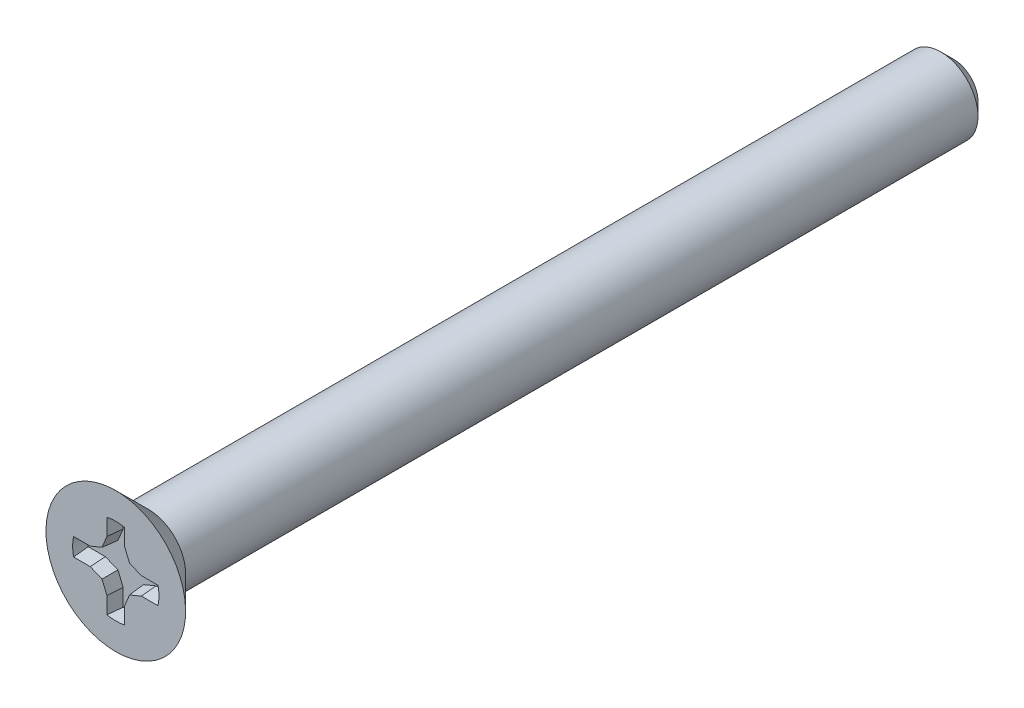
ISO-10303-21;
HEADER;
FILE_DESCRIPTION(('STEP AP214'),'2;1');
FILE_NAME('part.step','',(''),(''),'','','');
FILE_SCHEMA(('AUTOMOTIVE_DESIGN { 1 0 10303 214 1 1 1 1 }'));
ENDSEC;
DATA;
#1=APPLICATION_CONTEXT('core data for automotive mechanical design processes');
#2=APPLICATION_PROTOCOL_DEFINITION('international standard','automotive_design',2000,#1);
#3=PRODUCT_CONTEXT('',#1,'mechanical');
#4=PRODUCT('Part','Part','',(#3));
#5=PRODUCT_RELATED_PRODUCT_CATEGORY('part','',(#4));
#6=PRODUCT_DEFINITION_FORMATION('','',#4);
#7=PRODUCT_DEFINITION_CONTEXT('part definition',#1,'design');
#8=PRODUCT_DEFINITION('design','',#6,#7);
#9=PRODUCT_DEFINITION_SHAPE('','',#8);
#10=(LENGTH_UNIT() NAMED_UNIT(*) SI_UNIT(.MILLI.,.METRE.));
#11=(NAMED_UNIT(*) PLANE_ANGLE_UNIT() SI_UNIT($,.RADIAN.));
#12=(NAMED_UNIT(*) SI_UNIT($,.STERADIAN.) SOLID_ANGLE_UNIT());
#13=UNCERTAINTY_MEASURE_WITH_UNIT(LENGTH_MEASURE(1.E-05),#10,'distance_accuracy_value','');
#14=(GEOMETRIC_REPRESENTATION_CONTEXT(3) GLOBAL_UNCERTAINTY_ASSIGNED_CONTEXT((#13)) GLOBAL_UNIT_ASSIGNED_CONTEXT((#10,
#11,#12)) REPRESENTATION_CONTEXT('',''));
#15=CARTESIAN_POINT('',(0.,0.,0.));
#16=DIRECTION('',(0.,0.,1.));
#17=DIRECTION('',(1.,0.,0.));
#18=AXIS2_PLACEMENT_3D('',#15,#16,#17);
#19=CARTESIAN_POINT('',(0.,0.,0.96));
#20=DIRECTION('',(0.,0.,-1.));
#21=DIRECTION('',(0.,1.,0.));
#22=AXIS2_PLACEMENT_3D('',#19,#20,#21);
#23=PLANE('',#22);
#24=CARTESIAN_POINT('',(0.,0.,0.96));
#25=DIRECTION('',(0.,0.,1.));
#26=DIRECTION('',(0.,-1.,0.));
#27=AXIS2_PLACEMENT_3D('',#24,#25,#26);
#28=CIRCLE('',#27,1.5);
#29=CARTESIAN_POINT('',(0.,-1.5,0.96));
#30=VERTEX_POINT('',#29);
#31=EDGE_CURVE('E182',#30,#30,#28,.T.);
#32=ORIENTED_EDGE('',*,*,#31,.T.);
#33=EDGE_LOOP('',(#32));
#34=FACE_BOUND('',#33,.T.);
#35=CARTESIAN_POINT('',(0.,0.,0.96));
#36=DIRECTION('',(0.,0.,1.));
#37=DIRECTION('',(1.,0.,0.));
#38=AXIS2_PLACEMENT_3D('',#35,#36,#37);
#39=CIRCLE('',#38,0.927100000000001);
#40=CARTESIAN_POINT('',(0.90731701185418,-0.190500000000004,0.96));
#41=VERTEX_POINT('',#40);
#42=CARTESIAN_POINT('',(0.907317011854182,0.190500000000001,0.96));
#43=VERTEX_POINT('',#42);
#44=EDGE_CURVE('E200',#41,#43,#39,.T.);
#45=ORIENTED_EDGE('',*,*,#44,.F.);
#46=DIRECTION('',(-1.,0.,0.));
#47=VECTOR('',#46,1.);
#48=CARTESIAN_POINT('',(0.,-0.190500000000001,0.96));
#49=LINE('',#48,#47);
#50=CARTESIAN_POINT('',(0.548908505927091,-0.190500000000003,0.96));
#51=VERTEX_POINT('',#50);
#52=EDGE_CURVE('E210',#41,#51,#49,.T.);
#53=ORIENTED_EDGE('',*,*,#52,.T.);
#54=DIRECTION('',(-0.923879532511288,-0.382683432365088,0.));
#55=VECTOR('',#54,1.);
#56=CARTESIAN_POINT('',(0.147737710475553,-0.356670384304032,0.96));
#57=LINE('',#56,#55);
#58=CARTESIAN_POINT('',(0.295475420951106,-0.295475420951108,0.96));
#59=VERTEX_POINT('',#58);
#60=EDGE_CURVE('E214',#51,#59,#57,.T.);
#61=ORIENTED_EDGE('',*,*,#60,.T.);
#62=DIRECTION('',(-0.382683432365094,-0.923879532511285,0.));
#63=VECTOR('',#62,1.);
#64=CARTESIAN_POINT('',(0.356670384304031,-0.147737710475555,0.96));
#65=LINE('',#64,#63);
#66=CARTESIAN_POINT('',(0.190499999999999,-0.548908505927092,0.96));
#67=VERTEX_POINT('',#66);
#68=EDGE_CURVE('E218',#59,#67,#65,.T.);
#69=ORIENTED_EDGE('',*,*,#68,.T.);
#70=DIRECTION('',(0.,1.,0.));
#71=VECTOR('',#70,1.);
#72=CARTESIAN_POINT('',(0.190500000000001,0.,0.96));
#73=LINE('',#72,#71);
#74=CARTESIAN_POINT('',(0.190499999999998,-0.907317011854183,0.96));
#75=VERTEX_POINT('',#74);
#76=EDGE_CURVE('E222',#75,#67,#73,.T.);
#77=ORIENTED_EDGE('',*,*,#76,.F.);
#78=CARTESIAN_POINT('',(0.,0.,0.96));
#79=DIRECTION('',(0.,0.,1.));
#80=DIRECTION('',(0.,-1.,0.));
#81=AXIS2_PLACEMENT_3D('',#78,#79,#80);
#82=CIRCLE('',#81,0.927100000000001);
#83=CARTESIAN_POINT('',(-0.190500000000001,-0.907317011854181,0.96));
#84=VERTEX_POINT('',#83);
#85=EDGE_CURVE('E228',#84,#75,#82,.T.);
#86=ORIENTED_EDGE('',*,*,#85,.F.);
#87=DIRECTION('',(0.,1.,0.));
#88=VECTOR('',#87,1.);
#89=CARTESIAN_POINT('',(-0.190500000000001,0.,0.96));
#90=LINE('',#89,#88);
#91=CARTESIAN_POINT('',(-0.190500000000001,-0.548908505927091,0.96));
#92=VERTEX_POINT('',#91);
#93=EDGE_CURVE('E232',#84,#92,#90,.T.);
#94=ORIENTED_EDGE('',*,*,#93,.T.);
#95=DIRECTION('',(-0.382683432365091,0.923879532511286,0.));
#96=VECTOR('',#95,1.);
#97=CARTESIAN_POINT('',(-0.356670384304031,-0.147737710475554,0.96));
#98=LINE('',#97,#96);
#99=CARTESIAN_POINT('',(-0.295475420951107,-0.295475420951107,0.96));
#100=VERTEX_POINT('',#99);
#101=EDGE_CURVE('E236',#92,#100,#98,.T.);
#102=ORIENTED_EDGE('',*,*,#101,.T.);
#103=DIRECTION('',(-0.923879532511287,0.38268343236509,0.));
#104=VECTOR('',#103,1.);
#105=CARTESIAN_POINT('',(-0.147737710475554,-0.356670384304031,0.96));
#106=LINE('',#105,#104);
#107=CARTESIAN_POINT('',(-0.548908505927092,-0.190500000000001,0.96));
#108=VERTEX_POINT('',#107);
#109=EDGE_CURVE('E240',#100,#108,#106,.T.);
#110=ORIENTED_EDGE('',*,*,#109,.T.);
#111=DIRECTION('',(1.,0.,0.));
#112=VECTOR('',#111,1.);
#113=CARTESIAN_POINT('',(0.,-0.190500000000001,0.96));
#114=LINE('',#113,#112);
#115=CARTESIAN_POINT('',(-0.907317011854182,-0.190500000000001,0.96));
#116=VERTEX_POINT('',#115);
#117=EDGE_CURVE('E244',#116,#108,#114,.T.);
#118=ORIENTED_EDGE('',*,*,#117,.F.);
#119=CARTESIAN_POINT('',(0.,0.,0.96));
#120=DIRECTION('',(0.,0.,1.));
#121=DIRECTION('',(-1.,0.,0.));
#122=AXIS2_PLACEMENT_3D('',#119,#120,#121);
#123=CIRCLE('',#122,0.927100000000001);
#124=CARTESIAN_POINT('',(-0.907317011854179,0.190500000000011,0.96));
#125=VERTEX_POINT('',#124);
#126=EDGE_CURVE('E248',#125,#116,#123,.T.);
#127=ORIENTED_EDGE('',*,*,#126,.F.);
#128=DIRECTION('',(1.,0.,0.));
#129=VECTOR('',#128,1.);
#130=CARTESIAN_POINT('',(0.,0.190500000000001,0.96));
#131=LINE('',#130,#129);
#132=CARTESIAN_POINT('',(-0.548908505927089,0.190500000000007,0.96));
#133=VERTEX_POINT('',#132);
#134=EDGE_CURVE('E181',#125,#133,#131,.T.);
#135=ORIENTED_EDGE('',*,*,#134,.T.);
#136=DIRECTION('',(0.92387953251129,0.382683432365081,0.));
#137=VECTOR('',#136,1.);
#138=CARTESIAN_POINT('',(-0.14773771047555,0.356670384304033,0.96));
#139=LINE('',#138,#137);
#140=CARTESIAN_POINT('',(-0.295475420951104,0.295475420951111,0.96));
#141=VERTEX_POINT('',#140);
#142=EDGE_CURVE('E172',#133,#141,#139,.T.);
#143=ORIENTED_EDGE('',*,*,#142,.T.);
#144=DIRECTION('',(0.3826834323651,0.923879532511283,0.));
#145=VECTOR('',#144,1.);
#146=CARTESIAN_POINT('',(-0.35667038430403,0.147737710475558,0.96));
#147=LINE('',#146,#145);
#148=CARTESIAN_POINT('',(-0.190499999999995,0.548908505927094,0.96));
#149=VERTEX_POINT('',#148);
#150=EDGE_CURVE('E171',#141,#149,#147,.T.);
#151=ORIENTED_EDGE('',*,*,#150,.T.);
#152=DIRECTION('',(0.,-1.,0.));
#153=VECTOR('',#152,1.);
#154=CARTESIAN_POINT('',(-0.190500000000001,0.,0.96));
#155=LINE('',#154,#153);
#156=CARTESIAN_POINT('',(-0.190499999999992,0.907317011854184,0.96));
#157=VERTEX_POINT('',#156);
#158=EDGE_CURVE('E128',#157,#149,#155,.T.);
#159=ORIENTED_EDGE('',*,*,#158,.F.);
#160=CARTESIAN_POINT('',(0.,0.,0.96));
#161=DIRECTION('',(0.,0.,1.));
#162=DIRECTION('',(1.,0.,0.));
#163=AXIS2_PLACEMENT_3D('',#160,#161,#162);
#164=CIRCLE('',#163,0.9271);
#165=CARTESIAN_POINT('',(0.190500000000001,0.907317011854181,0.96));
#166=VERTEX_POINT('',#165);
#167=EDGE_CURVE('E135',#157,#166,#164,.F.);
#168=ORIENTED_EDGE('',*,*,#167,.T.);
#169=DIRECTION('',(0.,-1.,0.));
#170=VECTOR('',#169,1.);
#171=CARTESIAN_POINT('',(0.190500000000001,0.,0.96));
#172=LINE('',#171,#170);
#173=CARTESIAN_POINT('',(0.190500000000001,0.548908505927091,0.96));
#174=VERTEX_POINT('',#173);
#175=EDGE_CURVE('E187',#166,#174,#172,.T.);
#176=ORIENTED_EDGE('',*,*,#175,.T.);
#177=DIRECTION('',(0.382683432365091,-0.923879532511286,0.));
#178=VECTOR('',#177,1.);
#179=CARTESIAN_POINT('',(0.356670384304031,0.147737710475554,0.96));
#180=LINE('',#179,#178);
#181=CARTESIAN_POINT('',(0.295475420951107,0.295475420951107,0.96));
#182=VERTEX_POINT('',#181);
#183=EDGE_CURVE('E191',#174,#182,#180,.T.);
#184=ORIENTED_EDGE('',*,*,#183,.T.);
#185=DIRECTION('',(0.923879532511287,-0.38268343236509,0.));
#186=VECTOR('',#185,1.);
#187=CARTESIAN_POINT('',(0.147737710475554,0.356670384304031,0.96));
#188=LINE('',#187,#186);
#189=CARTESIAN_POINT('',(0.548908505927092,0.190500000000001,0.96));
#190=VERTEX_POINT('',#189);
#191=EDGE_CURVE('E194',#182,#190,#188,.T.);
#192=ORIENTED_EDGE('',*,*,#191,.T.);
#193=DIRECTION('',(-1.,0.,0.));
#194=VECTOR('',#193,1.);
#195=CARTESIAN_POINT('',(0.,0.190500000000001,0.96));
#196=LINE('',#195,#194);
#197=EDGE_CURVE('E197',#43,#190,#196,.T.);
#198=ORIENTED_EDGE('',*,*,#197,.F.);
#199=EDGE_LOOP('',(#45,#53,#61,#69,#77,#86,#94,#102,#110,#118,#127,#135,#143,#151,#159,#168,
#176,#184,#192,#198));
#200=FACE_BOUND('',#199,.T.);
#201=ADVANCED_FACE('F40',(#34,#200),#23,.F.);
#202=CARTESIAN_POINT('',(0.,0.,0.260000000000001));
#203=DIRECTION('',(0.,0.,1.));
#204=DIRECTION('',(0.,-1.,0.));
#205=AXIS2_PLACEMENT_3D('',#202,#203,#204);
#206=CONICAL_SURFACE('',#205,0.8,0.785398163397449);
#207=ORIENTED_EDGE('',*,*,#31,.F.);
#208=EDGE_LOOP('',(#207));
#209=FACE_BOUND('',#208,.T.);
#210=CARTESIAN_POINT('',(0.,0.,0.26));
#211=DIRECTION('',(0.,0.,-1.));
#212=DIRECTION('',(0.,1.,0.));
#213=AXIS2_PLACEMENT_3D('',#210,#211,#212);
#214=CIRCLE('',#213,0.8);
#215=CARTESIAN_POINT('',(0.,0.8,0.26));
#216=VERTEX_POINT('',#215);
#217=EDGE_CURVE('E44',#216,#216,#214,.T.);
#218=ORIENTED_EDGE('',*,*,#217,.F.);
#219=EDGE_LOOP('',(#218));
#220=FACE_BOUND('',#219,.T.);
#221=ADVANCED_FACE('F345',(#209,#220),#206,.T.);
#222=CARTESIAN_POINT('',(0.,0.,0.64));
#223=DIRECTION('',(0.,0.,1.));
#224=DIRECTION('',(1.,0.,0.));
#225=AXIS2_PLACEMENT_3D('',#222,#223,#224);
#226=CYLINDRICAL_SURFACE('',#225,0.9271);
#227=ORIENTED_EDGE('',*,*,#167,.F.);
#228=CARTESIAN_POINT('',(0.,0.,-1.21742496367604));
#229=DIRECTION('',(0.996194698091746,0.,0.0871557427476584));
#230=DIRECTION('',(-0.0871557427476584,0.,0.996194698091746));
#231=AXIS2_PLACEMENT_3D('',#228,#229,#230);
#232=ELLIPSE('',#231,10.6372795500605,0.9271);
#233=CARTESIAN_POINT('',(-0.162503627671696,0.912746942472852,0.64));
#234=VERTEX_POINT('',#233);
#235=EDGE_CURVE('E253',#234,#157,#232,.T.);
#236=ORIENTED_EDGE('',*,*,#235,.F.);
#237=CARTESIAN_POINT('',(0.,0.,0.64));
#238=DIRECTION('',(0.,0.,1.));
#239=DIRECTION('',(1.,0.,0.));
#240=AXIS2_PLACEMENT_3D('',#237,#238,#239);
#241=CIRCLE('',#240,0.9271);
#242=CARTESIAN_POINT('',(0.162503627671705,0.91274694247285,0.64));
#243=VERTEX_POINT('',#242);
#244=EDGE_CURVE('E58',#234,#243,#241,.F.);
#245=ORIENTED_EDGE('',*,*,#244,.T.);
#246=CARTESIAN_POINT('',(0.,0.,-1.21742496367605));
#247=DIRECTION('',(-0.996194698091746,0.,0.0871557427476584));
#248=DIRECTION('',(0.0871557427476584,0.,0.996194698091746));
#249=AXIS2_PLACEMENT_3D('',#246,#247,#248);
#250=ELLIPSE('',#249,10.6372795500605,0.9271);
#251=EDGE_CURVE('E185',#243,#166,#250,.F.);
#252=ORIENTED_EDGE('',*,*,#251,.T.);
#253=EDGE_LOOP('',(#227,#236,#245,#252));
#254=FACE_BOUND('',#253,.T.);
#255=ADVANCED_FACE('F351',(#254),#226,.F.);
#256=CARTESIAN_POINT('',(0.190500000000001,0.,0.96));
#257=DIRECTION('',(-0.996194698091746,0.,0.0871557427476584));
#258=DIRECTION('',(0.0871557427476584,0.,0.996194698091746));
#259=AXIS2_PLACEMENT_3D('',#256,#257,#258);
#260=PLANE('',#259);
#261=ORIENTED_EDGE('',*,*,#175,.F.);
#262=ORIENTED_EDGE('',*,*,#251,.F.);
#263=DIRECTION('',(0.,-1.,0.));
#264=VECTOR('',#263,1.);
#265=CARTESIAN_POINT('',(0.162503627671706,0.,0.64));
#266=LINE('',#265,#264);
#267=CARTESIAN_POINT('',(0.162503627671706,0.543339681229228,0.64));
#268=VERTEX_POINT('',#267);
#269=EDGE_CURVE('E205',#243,#268,#266,.T.);
#270=ORIENTED_EDGE('',*,*,#269,.T.);
#271=DIRECTION('',(0.0871426484044397,0.0173337504938601,0.996045029063886));
#272=VECTOR('',#271,1.);
#273=CARTESIAN_POINT('',(0.189670868802891,0.548743581477806,0.950522987051174));
#274=LINE('',#273,#272);
#275=EDGE_CURVE('E304',#268,#174,#274,.T.);
#276=ORIENTED_EDGE('',*,*,#275,.T.);
#277=EDGE_LOOP('',(#261,#262,#270,#276));
#278=FACE_BOUND('',#277,.T.);
#279=ADVANCED_FACE('F363',(#278),#260,.T.);
#280=CARTESIAN_POINT('',(0.356670384304031,0.147737710475554,0.96));
#281=DIRECTION('',(-0.920363891963224,-0.381227206369655,0.0871557427476583));
#282=DIRECTION('',(0.382683432365091,-0.923879532511286,0.));
#283=AXIS2_PLACEMENT_3D('',#280,#281,#282);
#284=PLANE('',#283);
#285=ORIENTED_EDGE('',*,*,#183,.F.);
#286=ORIENTED_EDGE('',*,*,#275,.F.);
#287=DIRECTION('',(0.382683432365091,-0.923879532511286,0.));
#288=VECTOR('',#287,1.);
#289=CARTESIAN_POINT('',(0.330805108925354,0.137023962619191,0.64));
#290=LINE('',#289,#288);
#291=CARTESIAN_POINT('',(0.274047925238381,0.274047925238381,0.64));
#292=VERTEX_POINT('',#291);
#293=EDGE_CURVE('E316',#268,#292,#290,.T.);
#294=ORIENTED_EDGE('',*,*,#293,.T.);
#295=DIRECTION('',(0.0666626913468323,0.0666626913468322,0.995546167269401));
#296=VECTOR('',#295,1.);
#297=CARTESIAN_POINT('',(0.29509083238943,0.29509083238943,0.954256522489298));
#298=LINE('',#297,#296);
#299=EDGE_CURVE('E306',#292,#182,#298,.T.);
#300=ORIENTED_EDGE('',*,*,#299,.T.);
#301=EDGE_LOOP('',(#285,#286,#294,#300));
#302=FACE_BOUND('',#301,.T.);
#303=ADVANCED_FACE('F455',(#302),#284,.T.);
#304=CARTESIAN_POINT('',(0.147737710475554,0.356670384304031,0.96));
#305=DIRECTION('',(-0.381227206369654,-0.920363891963224,0.0871557427476582));
#306=DIRECTION('',(0.923879532511287,-0.38268343236509,0.));
#307=AXIS2_PLACEMENT_3D('',#304,#305,#306);
#308=PLANE('',#307);
#309=ORIENTED_EDGE('',*,*,#191,.F.);
#310=ORIENTED_EDGE('',*,*,#299,.F.);
#311=DIRECTION('',(0.923879532511287,-0.38268343236509,0.));
#312=VECTOR('',#311,1.);
#313=CARTESIAN_POINT('',(0.137023962619191,0.330805108925353,0.64));
#314=LINE('',#313,#312);
#315=CARTESIAN_POINT('',(0.543339681229228,0.162503627671705,0.64));
#316=VERTEX_POINT('',#315);
#317=EDGE_CURVE('E313',#292,#316,#314,.T.);
#318=ORIENTED_EDGE('',*,*,#317,.T.);
#319=DIRECTION('',(-0.0173337504938603,-0.0871426484044395,-0.996045029063886));
#320=VECTOR('',#319,1.);
#321=CARTESIAN_POINT('',(0.548743581477806,0.18967086880289,0.950522987051174));
#322=LINE('',#321,#320);
#323=EDGE_CURVE('E308',#316,#190,#322,.F.);
#324=ORIENTED_EDGE('',*,*,#323,.T.);
#325=EDGE_LOOP('',(#309,#310,#318,#324));
#326=FACE_BOUND('',#325,.T.);
#327=ADVANCED_FACE('F451',(#326),#308,.T.);
#328=CARTESIAN_POINT('',(0.,0.190500000000001,0.96));
#329=DIRECTION('',(0.,-0.996194698091746,0.0871557427476582));
#330=DIRECTION('',(0.,-0.0871557427476582,-0.996194698091746));
#331=AXIS2_PLACEMENT_3D('',#328,#329,#330);
#332=PLANE('',#331);
#333=ORIENTED_EDGE('',*,*,#197,.T.);
#334=ORIENTED_EDGE('',*,*,#323,.F.);
#335=DIRECTION('',(1.,0.,0.));
#336=VECTOR('',#335,1.);
#337=CARTESIAN_POINT('',(0.,0.162503627671705,0.64));
#338=LINE('',#337,#336);
#339=CARTESIAN_POINT('',(0.912746942472851,0.162503627671705,0.64));
#340=VERTEX_POINT('',#339);
#341=EDGE_CURVE('E209',#340,#316,#338,.F.);
#342=ORIENTED_EDGE('',*,*,#341,.F.);
#343=CARTESIAN_POINT('',(0.,0.,-1.21742496367605));
#344=DIRECTION('',(0.,-0.996194698091746,0.0871557427476582));
#345=DIRECTION('',(0.,0.0871557427476582,0.996194698091746));
#346=AXIS2_PLACEMENT_3D('',#343,#344,#345);
#347=ELLIPSE('',#346,10.6372795500605,0.927100000000001);
#348=EDGE_CURVE('E206',#340,#43,#347,.T.);
#349=ORIENTED_EDGE('',*,*,#348,.T.);
#350=EDGE_LOOP('',(#333,#334,#342,#349));
#351=FACE_BOUND('',#350,.T.);
#352=ADVANCED_FACE('F359',(#351),#332,.T.);
#353=CARTESIAN_POINT('',(0.,0.,0.64));
#354=DIRECTION('',(0.,0.,1.));
#355=DIRECTION('',(1.,0.,0.));
#356=AXIS2_PLACEMENT_3D('',#353,#354,#355);
#357=CYLINDRICAL_SURFACE('',#356,0.927100000000001);
#358=ORIENTED_EDGE('',*,*,#44,.T.);
#359=ORIENTED_EDGE('',*,*,#348,.F.);
#360=CARTESIAN_POINT('',(0.,0.,0.64));
#361=DIRECTION('',(0.,0.,1.));
#362=DIRECTION('',(1.,0.,0.));
#363=AXIS2_PLACEMENT_3D('',#360,#361,#362);
#364=CIRCLE('',#363,0.927100000000001);
#365=CARTESIAN_POINT('',(0.91274694247285,-0.162503627671709,0.64));
#366=VERTEX_POINT('',#365);
#367=EDGE_CURVE('E188',#366,#340,#364,.T.);
#368=ORIENTED_EDGE('',*,*,#367,.F.);
#369=CARTESIAN_POINT('',(0.,0.,-1.21742496367604));
#370=DIRECTION('',(0.,0.996194698091746,0.0871557427476585));
#371=DIRECTION('',(0.,-0.0871557427476585,0.996194698091746));
#372=AXIS2_PLACEMENT_3D('',#369,#370,#371);
#373=ELLIPSE('',#372,10.6372795500605,0.927100000000001);
#374=EDGE_CURVE('E203',#366,#41,#373,.F.);
#375=ORIENTED_EDGE('',*,*,#374,.T.);
#376=EDGE_LOOP('',(#358,#359,#368,#375));
#377=FACE_BOUND('',#376,.T.);
#378=ADVANCED_FACE('F356',(#377),#357,.F.);
#379=CARTESIAN_POINT('',(0.,0.,0.64));
#380=DIRECTION('',(0.,0.,1.));
#381=DIRECTION('',(1.,0.,0.));
#382=AXIS2_PLACEMENT_3D('',#379,#380,#381);
#383=PLANE('',#382);
#384=DIRECTION('',(-1.,0.,0.));
#385=VECTOR('',#384,1.);
#386=CARTESIAN_POINT('',(0.,-0.162503627671706,0.64));
#387=LINE('',#386,#385);
#388=CARTESIAN_POINT('',(0.543339681229227,-0.162503627671707,0.64));
#389=VERTEX_POINT('',#388);
#390=EDGE_CURVE('E291',#366,#389,#387,.T.);
#391=ORIENTED_EDGE('',*,*,#390,.F.);
#392=ORIENTED_EDGE('',*,*,#367,.T.);
#393=ORIENTED_EDGE('',*,*,#341,.T.);
#394=ORIENTED_EDGE('',*,*,#317,.F.);
#395=ORIENTED_EDGE('',*,*,#293,.F.);
#396=ORIENTED_EDGE('',*,*,#269,.F.);
#397=ORIENTED_EDGE('',*,*,#244,.F.);
#398=DIRECTION('',(0.,1.,0.));
#399=VECTOR('',#398,1.);
#400=CARTESIAN_POINT('',(-0.162503627671705,0.,0.64));
#401=LINE('',#400,#399);
#402=CARTESIAN_POINT('',(-0.1625036276717,0.54333968122923,0.64));
#403=VERTEX_POINT('',#402);
#404=EDGE_CURVE('E12',#234,#403,#401,.F.);
#405=ORIENTED_EDGE('',*,*,#404,.T.);
#406=DIRECTION('',(0.3826834323651,0.923879532511283,0.));
#407=VECTOR('',#406,1.);
#408=CARTESIAN_POINT('',(-0.330805108925352,0.137023962619194,0.64));
#409=LINE('',#408,#407);
#410=CARTESIAN_POINT('',(-0.274047925238378,0.274047925238384,0.64));
#411=VERTEX_POINT('',#410);
#412=EDGE_CURVE('E50',#411,#403,#409,.T.);
#413=ORIENTED_EDGE('',*,*,#412,.F.);
#414=DIRECTION('',(0.92387953251129,0.382683432365081,0.));
#415=VECTOR('',#414,1.);
#416=CARTESIAN_POINT('',(-0.137023962619187,0.330805108925355,0.64));
#417=LINE('',#416,#415);
#418=CARTESIAN_POINT('',(-0.543339681229226,0.162503627671711,0.64));
#419=VERTEX_POINT('',#418);
#420=EDGE_CURVE('E154',#419,#411,#417,.T.);
#421=ORIENTED_EDGE('',*,*,#420,.F.);
#422=DIRECTION('',(1.,0.,0.));
#423=VECTOR('',#422,1.);
#424=CARTESIAN_POINT('',(0.,0.162503627671706,0.64));
#425=LINE('',#424,#423);
#426=CARTESIAN_POINT('',(-0.912746942472849,0.162503627671715,0.64));
#427=VERTEX_POINT('',#426);
#428=EDGE_CURVE('E167',#427,#419,#425,.T.);
#429=ORIENTED_EDGE('',*,*,#428,.F.);
#430=CARTESIAN_POINT('',(0.,0.,0.64));
#431=DIRECTION('',(0.,0.,1.));
#432=DIRECTION('',(-1.,0.,0.));
#433=AXIS2_PLACEMENT_3D('',#430,#431,#432);
#434=CIRCLE('',#433,0.927100000000001);
#435=CARTESIAN_POINT('',(-0.912746942472851,-0.162503627671705,0.64));
#436=VERTEX_POINT('',#435);
#437=EDGE_CURVE('E143',#427,#436,#434,.T.);
#438=ORIENTED_EDGE('',*,*,#437,.T.);
#439=DIRECTION('',(-1.,0.,0.));
#440=VECTOR('',#439,1.);
#441=CARTESIAN_POINT('',(0.,-0.162503627671705,0.64));
#442=LINE('',#441,#440);
#443=CARTESIAN_POINT('',(-0.543339681229228,-0.162503627671705,0.64));
#444=VERTEX_POINT('',#443);
#445=EDGE_CURVE('E249',#436,#444,#442,.F.);
#446=ORIENTED_EDGE('',*,*,#445,.T.);
#447=DIRECTION('',(-0.923879532511287,0.38268343236509,0.));
#448=VECTOR('',#447,1.);
#449=CARTESIAN_POINT('',(-0.137023962619191,-0.330805108925353,0.64));
#450=LINE('',#449,#448);
#451=CARTESIAN_POINT('',(-0.274047925238381,-0.274047925238381,0.64));
#452=VERTEX_POINT('',#451);
#453=EDGE_CURVE('E273',#452,#444,#450,.T.);
#454=ORIENTED_EDGE('',*,*,#453,.F.);
#455=DIRECTION('',(-0.382683432365091,0.923879532511286,0.));
#456=VECTOR('',#455,1.);
#457=CARTESIAN_POINT('',(-0.330805108925353,-0.137023962619191,0.64));
#458=LINE('',#457,#456);
#459=CARTESIAN_POINT('',(-0.162503627671706,-0.543339681229227,0.64));
#460=VERTEX_POINT('',#459);
#461=EDGE_CURVE('E276',#460,#452,#458,.T.);
#462=ORIENTED_EDGE('',*,*,#461,.F.);
#463=DIRECTION('',(0.,1.,0.));
#464=VECTOR('',#463,1.);
#465=CARTESIAN_POINT('',(-0.162503627671706,0.,0.64));
#466=LINE('',#465,#464);
#467=CARTESIAN_POINT('',(-0.162503627671705,-0.912746942472851,0.64));
#468=VERTEX_POINT('',#467);
#469=EDGE_CURVE('E270',#468,#460,#466,.T.);
#470=ORIENTED_EDGE('',*,*,#469,.F.);
#471=CARTESIAN_POINT('',(0.,0.,0.64));
#472=DIRECTION('',(0.,0.,1.));
#473=DIRECTION('',(0.,-1.,0.));
#474=AXIS2_PLACEMENT_3D('',#471,#472,#473);
#475=CIRCLE('',#474,0.927100000000001);
#476=CARTESIAN_POINT('',(0.162503627671702,-0.912746942472852,0.64));
#477=VERTEX_POINT('',#476);
#478=EDGE_CURVE('E225',#468,#477,#475,.T.);
#479=ORIENTED_EDGE('',*,*,#478,.T.);
#480=DIRECTION('',(0.,-1.,0.));
#481=VECTOR('',#480,1.);
#482=CARTESIAN_POINT('',(0.162503627671705,0.,0.64));
#483=LINE('',#482,#481);
#484=CARTESIAN_POINT('',(0.162503627671703,-0.543339681229229,0.64));
#485=VERTEX_POINT('',#484);
#486=EDGE_CURVE('E229',#477,#485,#483,.F.);
#487=ORIENTED_EDGE('',*,*,#486,.T.);
#488=DIRECTION('',(-0.382683432365094,-0.923879532511285,0.));
#489=VECTOR('',#488,1.);
#490=CARTESIAN_POINT('',(0.330805108925353,-0.137023962619192,0.64));
#491=LINE('',#490,#489);
#492=CARTESIAN_POINT('',(0.27404792523838,-0.274047925238382,0.64));
#493=VERTEX_POINT('',#492);
#494=EDGE_CURVE('E294',#493,#485,#491,.T.);
#495=ORIENTED_EDGE('',*,*,#494,.F.);
#496=DIRECTION('',(-0.923879532511288,-0.382683432365088,0.));
#497=VECTOR('',#496,1.);
#498=CARTESIAN_POINT('',(0.13702396261919,-0.330805108925354,0.64));
#499=LINE('',#498,#497);
#500=EDGE_CURVE('E297',#389,#493,#499,.T.);
#501=ORIENTED_EDGE('',*,*,#500,.F.);
#502=EDGE_LOOP('',(#391,#392,#393,#394,#395,#396,#397,#405,#413,#421,#429,#438,#446,#454,#462,
#470,#479,#487,#495,#501));
#503=FACE_BOUND('',#502,.T.);
#504=ADVANCED_FACE('F153',(#503),#383,.T.);
#505=CARTESIAN_POINT('',(0.,-0.190500000000001,0.96));
#506=DIRECTION('',(0.,0.996194698091746,0.0871557427476585));
#507=DIRECTION('',(0.,-0.0871557427476585,0.996194698091746));
#508=AXIS2_PLACEMENT_3D('',#505,#506,#507);
#509=PLANE('',#508);
#510=ORIENTED_EDGE('',*,*,#52,.F.);
#511=ORIENTED_EDGE('',*,*,#374,.F.);
#512=ORIENTED_EDGE('',*,*,#390,.T.);
#513=DIRECTION('',(0.01733375049386,-0.0871426484044399,0.996045029063886));
#514=VECTOR('',#513,1.);
#515=CARTESIAN_POINT('',(0.548743581477805,-0.189670868802893,0.950522987051174));
#516=LINE('',#515,#514);
#517=EDGE_CURVE('E213',#389,#51,#516,.T.);
#518=ORIENTED_EDGE('',*,*,#517,.T.);
#519=EDGE_LOOP('',(#510,#511,#512,#518));
#520=FACE_BOUND('',#519,.T.);
#521=ADVANCED_FACE('F365',(#520),#509,.T.);
#522=CARTESIAN_POINT('',(0.147737710475553,-0.356670384304032,0.96));
#523=DIRECTION('',(-0.381227206369652,0.920363891963225,0.0871557427476585));
#524=DIRECTION('',(-0.923879532511288,-0.382683432365088,0.));
#525=AXIS2_PLACEMENT_3D('',#522,#523,#524);
#526=PLANE('',#525);
#527=ORIENTED_EDGE('',*,*,#60,.F.);
#528=ORIENTED_EDGE('',*,*,#517,.F.);
#529=ORIENTED_EDGE('',*,*,#500,.T.);
#530=DIRECTION('',(0.0666626913468321,-0.0666626913468327,0.995546167269401));
#531=VECTOR('',#530,1.);
#532=CARTESIAN_POINT('',(0.295090832389429,-0.295090832389431,0.954256522489298));
#533=LINE('',#532,#531);
#534=EDGE_CURVE('E217',#493,#59,#533,.T.);
#535=ORIENTED_EDGE('',*,*,#534,.T.);
#536=EDGE_LOOP('',(#527,#528,#529,#535));
#537=FACE_BOUND('',#536,.T.);
#538=ADVANCED_FACE('F392',(#537),#526,.T.);
#539=CARTESIAN_POINT('',(0.356670384304031,-0.147737710475555,0.96));
#540=DIRECTION('',(-0.920363891963223,0.381227206369657,0.0871557427476584));
#541=DIRECTION('',(-0.382683432365094,-0.923879532511285,0.));
#542=AXIS2_PLACEMENT_3D('',#539,#540,#541);
#543=PLANE('',#542);
#544=ORIENTED_EDGE('',*,*,#68,.F.);
#545=ORIENTED_EDGE('',*,*,#534,.F.);
#546=ORIENTED_EDGE('',*,*,#494,.T.);
#547=DIRECTION('',(-0.0871426484044396,0.0173337504938608,-0.996045029063886));
#548=VECTOR('',#547,1.);
#549=CARTESIAN_POINT('',(0.189670868802888,-0.548743581477807,0.950522987051174));
#550=LINE('',#549,#548);
#551=EDGE_CURVE('E221',#485,#67,#550,.F.);
#552=ORIENTED_EDGE('',*,*,#551,.T.);
#553=EDGE_LOOP('',(#544,#545,#546,#552));
#554=FACE_BOUND('',#553,.T.);
#555=ADVANCED_FACE('F378',(#554),#543,.T.);
#556=CARTESIAN_POINT('',(0.190500000000001,0.,0.96));
#557=DIRECTION('',(-0.996194698091746,0.,0.0871557427476584));
#558=DIRECTION('',(0.0871557427476584,0.,0.996194698091746));
#559=AXIS2_PLACEMENT_3D('',#556,#557,#558);
#560=PLANE('',#559);
#561=ORIENTED_EDGE('',*,*,#76,.T.);
#562=ORIENTED_EDGE('',*,*,#551,.F.);
#563=ORIENTED_EDGE('',*,*,#486,.F.);
#564=CARTESIAN_POINT('',(0.,0.,-1.21742496367604));
#565=DIRECTION('',(-0.996194698091746,0.,0.0871557427476584));
#566=DIRECTION('',(0.0871557427476584,0.,0.996194698091746));
#567=AXIS2_PLACEMENT_3D('',#564,#565,#566);
#568=ELLIPSE('',#567,10.6372795500605,0.927100000000001);
#569=EDGE_CURVE('E224',#477,#75,#568,.T.);
#570=ORIENTED_EDGE('',*,*,#569,.T.);
#571=EDGE_LOOP('',(#561,#562,#563,#570));
#572=FACE_BOUND('',#571,.T.);
#573=ADVANCED_FACE('F369',(#572),#560,.T.);
#574=CARTESIAN_POINT('',(0.,0.,0.64));
#575=DIRECTION('',(0.,0.,1.));
#576=DIRECTION('',(0.,-1.,0.));
#577=AXIS2_PLACEMENT_3D('',#574,#575,#576);
#578=CYLINDRICAL_SURFACE('',#577,0.927100000000001);
#579=ORIENTED_EDGE('',*,*,#85,.T.);
#580=ORIENTED_EDGE('',*,*,#569,.F.);
#581=ORIENTED_EDGE('',*,*,#478,.F.);
#582=CARTESIAN_POINT('',(0.,0.,-1.21742496367605));
#583=DIRECTION('',(0.996194698091746,0.,0.0871557427476584));
#584=DIRECTION('',(-0.0871557427476584,0.,0.996194698091746));
#585=AXIS2_PLACEMENT_3D('',#582,#583,#584);
#586=ELLIPSE('',#585,10.6372795500605,0.927100000000001);
#587=EDGE_CURVE('E231',#468,#84,#586,.F.);
#588=ORIENTED_EDGE('',*,*,#587,.T.);
#589=EDGE_LOOP('',(#579,#580,#581,#588));
#590=FACE_BOUND('',#589,.T.);
#591=ADVANCED_FACE('F366',(#590),#578,.F.);
#592=CARTESIAN_POINT('',(-0.190500000000001,0.,0.96));
#593=DIRECTION('',(0.996194698091746,0.,0.0871557427476584));
#594=DIRECTION('',(0.0871557427476584,0.,-0.996194698091746));
#595=AXIS2_PLACEMENT_3D('',#592,#593,#594);
#596=PLANE('',#595);
#597=ORIENTED_EDGE('',*,*,#93,.F.);
#598=ORIENTED_EDGE('',*,*,#587,.F.);
#599=ORIENTED_EDGE('',*,*,#469,.T.);
#600=DIRECTION('',(-0.0871426484044397,-0.0173337504938605,0.996045029063886));
#601=VECTOR('',#600,1.);
#602=CARTESIAN_POINT('',(-0.189670868802891,-0.548743581477806,0.950522987051174));
#603=LINE('',#602,#601);
#604=EDGE_CURVE('E235',#460,#92,#603,.T.);
#605=ORIENTED_EDGE('',*,*,#604,.T.);
#606=EDGE_LOOP('',(#597,#598,#599,#605));
#607=FACE_BOUND('',#606,.T.);
#608=ADVANCED_FACE('F368',(#607),#596,.T.);
#609=CARTESIAN_POINT('',(-0.356670384304031,-0.147737710475554,0.96));
#610=DIRECTION('',(0.920363891963224,0.381227206369655,0.0871557427476584));
#611=DIRECTION('',(-0.382683432365091,0.923879532511286,0.));
#612=AXIS2_PLACEMENT_3D('',#609,#610,#611);
#613=PLANE('',#612);
#614=ORIENTED_EDGE('',*,*,#101,.F.);
#615=ORIENTED_EDGE('',*,*,#604,.F.);
#616=ORIENTED_EDGE('',*,*,#461,.T.);
#617=DIRECTION('',(-0.0666626913468323,-0.0666626913468325,0.995546167269401));
#618=VECTOR('',#617,1.);
#619=CARTESIAN_POINT('',(-0.29509083238943,-0.29509083238943,0.954256522489298));
#620=LINE('',#619,#618);
#621=EDGE_CURVE('E239',#452,#100,#620,.T.);
#622=ORIENTED_EDGE('',*,*,#621,.T.);
#623=EDGE_LOOP('',(#614,#615,#616,#622));
#624=FACE_BOUND('',#623,.T.);
#625=ADVANCED_FACE('F375',(#624),#613,.T.);
#626=CARTESIAN_POINT('',(-0.147737710475554,-0.356670384304031,0.96));
#627=DIRECTION('',(0.381227206369654,0.920363891963224,0.0871557427476585));
#628=DIRECTION('',(-0.923879532511287,0.38268343236509,0.));
#629=AXIS2_PLACEMENT_3D('',#626,#627,#628);
#630=PLANE('',#629);
#631=ORIENTED_EDGE('',*,*,#109,.F.);
#632=ORIENTED_EDGE('',*,*,#621,.F.);
#633=ORIENTED_EDGE('',*,*,#453,.T.);
#634=DIRECTION('',(0.0173337504938603,0.0871426484044399,-0.996045029063886));
#635=VECTOR('',#634,1.);
#636=CARTESIAN_POINT('',(-0.548743581477806,-0.18967086880289,0.950522987051174));
#637=LINE('',#636,#635);
#638=EDGE_CURVE('E243',#444,#108,#637,.F.);
#639=ORIENTED_EDGE('',*,*,#638,.T.);
#640=EDGE_LOOP('',(#631,#632,#633,#639));
#641=FACE_BOUND('',#640,.T.);
#642=ADVANCED_FACE('F430',(#641),#630,.T.);
#643=CARTESIAN_POINT('',(0.,-0.190500000000001,0.96));
#644=DIRECTION('',(0.,0.996194698091746,0.0871557427476585));
#645=DIRECTION('',(0.,-0.0871557427476585,0.996194698091746));
#646=AXIS2_PLACEMENT_3D('',#643,#644,#645);
#647=PLANE('',#646);
#648=ORIENTED_EDGE('',*,*,#117,.T.);
#649=ORIENTED_EDGE('',*,*,#638,.F.);
#650=ORIENTED_EDGE('',*,*,#445,.F.);
#651=CARTESIAN_POINT('',(0.,0.,-1.21742496367604));
#652=DIRECTION('',(0.,0.996194698091746,0.0871557427476585));
#653=DIRECTION('',(0.,-0.0871557427476585,0.996194698091746));
#654=AXIS2_PLACEMENT_3D('',#651,#652,#653);
#655=ELLIPSE('',#654,10.6372795500605,0.927100000000001);
#656=EDGE_CURVE('E246',#436,#116,#655,.T.);
#657=ORIENTED_EDGE('',*,*,#656,.T.);
#658=EDGE_LOOP('',(#648,#649,#650,#657));
#659=FACE_BOUND('',#658,.T.);
#660=ADVANCED_FACE('F427',(#659),#647,.T.);
#661=CARTESIAN_POINT('',(0.,0.,0.64));
#662=DIRECTION('',(0.,0.,1.));
#663=DIRECTION('',(-1.,0.,0.));
#664=AXIS2_PLACEMENT_3D('',#661,#662,#663);
#665=CYLINDRICAL_SURFACE('',#664,0.927100000000001);
#666=ORIENTED_EDGE('',*,*,#126,.T.);
#667=ORIENTED_EDGE('',*,*,#656,.F.);
#668=ORIENTED_EDGE('',*,*,#437,.F.);
#669=CARTESIAN_POINT('',(0.,0.,-1.21742496367605));
#670=DIRECTION('',(0.,-0.996194698091746,0.0871557427476582));
#671=DIRECTION('',(0.,0.0871557427476582,0.996194698091746));
#672=AXIS2_PLACEMENT_3D('',#669,#670,#671);
#673=ELLIPSE('',#672,10.6372795500605,0.927100000000001);
#674=EDGE_CURVE('E251',#427,#125,#673,.F.);
#675=ORIENTED_EDGE('',*,*,#674,.T.);
#676=EDGE_LOOP('',(#666,#667,#668,#675));
#677=FACE_BOUND('',#676,.T.);
#678=ADVANCED_FACE('F42',(#677),#665,.F.);
#679=CARTESIAN_POINT('',(0.,0.190500000000001,0.96));
#680=DIRECTION('',(0.,-0.996194698091746,0.0871557427476582));
#681=DIRECTION('',(0.,-0.0871557427476582,-0.996194698091746));
#682=AXIS2_PLACEMENT_3D('',#679,#680,#681);
#683=PLANE('',#682);
#684=ORIENTED_EDGE('',*,*,#134,.F.);
#685=ORIENTED_EDGE('',*,*,#674,.F.);
#686=ORIENTED_EDGE('',*,*,#428,.T.);
#687=DIRECTION('',(-0.0173337504938594,0.0871426484044397,0.996045029063886));
#688=VECTOR('',#687,1.);
#689=CARTESIAN_POINT('',(-0.548743581477804,0.189670868802896,0.950522987051174));
#690=LINE('',#689,#688);
#691=EDGE_CURVE('E166',#419,#133,#690,.T.);
#692=ORIENTED_EDGE('',*,*,#691,.T.);
#693=EDGE_LOOP('',(#684,#685,#686,#692));
#694=FACE_BOUND('',#693,.T.);
#695=ADVANCED_FACE('F257',(#694),#683,.T.);
#696=CARTESIAN_POINT('',(-0.14773771047555,0.356670384304033,0.96));
#697=DIRECTION('',(0.381227206369645,-0.920363891963228,0.0871557427476582));
#698=DIRECTION('',(0.92387953251129,0.382683432365081,0.));
#699=AXIS2_PLACEMENT_3D('',#696,#697,#698);
#700=PLANE('',#699);
#701=ORIENTED_EDGE('',*,*,#142,.F.);
#702=ORIENTED_EDGE('',*,*,#691,.F.);
#703=ORIENTED_EDGE('',*,*,#420,.T.);
#704=DIRECTION('',(-0.0666626913468316,0.0666626913468328,0.995546167269401));
#705=VECTOR('',#704,1.);
#706=CARTESIAN_POINT('',(-0.295090832389427,0.295090832389433,0.954256522489298));
#707=LINE('',#706,#705);
#708=EDGE_CURVE('E163',#411,#141,#707,.T.);
#709=ORIENTED_EDGE('',*,*,#708,.T.);
#710=EDGE_LOOP('',(#701,#702,#703,#709));
#711=FACE_BOUND('',#710,.T.);
#712=ADVANCED_FACE('F162',(#711),#700,.T.);
#713=CARTESIAN_POINT('',(-0.35667038430403,0.147737710475558,0.96));
#714=DIRECTION('',(0.92036389196322,-0.381227206369664,0.0871557427476583));
#715=DIRECTION('',(0.3826834323651,0.923879532511283,0.));
#716=AXIS2_PLACEMENT_3D('',#713,#714,#715);
#717=PLANE('',#716);
#718=ORIENTED_EDGE('',*,*,#150,.F.);
#719=ORIENTED_EDGE('',*,*,#708,.F.);
#720=ORIENTED_EDGE('',*,*,#412,.T.);
#721=DIRECTION('',(0.0871426484044395,-0.017333750493861,-0.996045029063886));
#722=VECTOR('',#721,1.);
#723=CARTESIAN_POINT('',(-0.189670868802885,0.548743581477808,0.950522987051174));
#724=LINE('',#723,#722);
#725=EDGE_CURVE('E174',#403,#149,#724,.F.);
#726=ORIENTED_EDGE('',*,*,#725,.T.);
#727=EDGE_LOOP('',(#718,#719,#720,#726));
#728=FACE_BOUND('',#727,.T.);
#729=ADVANCED_FACE('F169',(#728),#717,.T.);
#730=CARTESIAN_POINT('',(-0.190500000000001,0.,0.96));
#731=DIRECTION('',(0.996194698091746,0.,0.0871557427476584));
#732=DIRECTION('',(0.0871557427476584,0.,-0.996194698091746));
#733=AXIS2_PLACEMENT_3D('',#730,#731,#732);
#734=PLANE('',#733);
#735=ORIENTED_EDGE('',*,*,#158,.T.);
#736=ORIENTED_EDGE('',*,*,#725,.F.);
#737=ORIENTED_EDGE('',*,*,#404,.F.);
#738=ORIENTED_EDGE('',*,*,#235,.T.);
#739=EDGE_LOOP('',(#735,#736,#737,#738));
#740=FACE_BOUND('',#739,.T.);
#741=ADVANCED_FACE('F342',(#740),#734,.T.);
#742=CARTESIAN_POINT('',(0.,0.5235,-17.04));
#743=DIRECTION('',(0.,0.,-1.));
#744=DIRECTION('',(0.,1.,0.));
#745=AXIS2_PLACEMENT_3D('',#742,#743,#744);
#746=PLANE('',#745);
#747=CARTESIAN_POINT('',(0.,0.,-17.04));
#748=DIRECTION('',(0.,0.,-1.));
#749=DIRECTION('',(0.,1.,0.));
#750=AXIS2_PLACEMENT_3D('',#747,#748,#749);
#751=CIRCLE('',#750,0.5235);
#752=CARTESIAN_POINT('',(0.,0.5235,-17.04));
#753=VERTEX_POINT('',#752);
#754=EDGE_CURVE('E325',#753,#753,#751,.T.);
#755=ORIENTED_EDGE('',*,*,#754,.T.);
#756=EDGE_LOOP('',(#755));
#757=FACE_BOUND('',#756,.T.);
#758=ADVANCED_FACE('F329',(#757),#746,.T.);
#759=CARTESIAN_POINT('',(0.,0.,-17.04));
#760=DIRECTION('',(0.,0.,1.));
#761=DIRECTION('',(0.,-1.,0.));
#762=AXIS2_PLACEMENT_3D('',#759,#760,#761);
#763=CONICAL_SURFACE('',#762,0.5235,0.78539816339745);
#764=CARTESIAN_POINT('',(0.,0.,-16.7635));
#765=DIRECTION('',(0.,0.,-1.));
#766=DIRECTION('',(0.,1.,0.));
#767=AXIS2_PLACEMENT_3D('',#764,#765,#766);
#768=CIRCLE('',#767,0.8);
#769=CARTESIAN_POINT('',(0.,0.8,-16.7635));
#770=VERTEX_POINT('',#769);
#771=EDGE_CURVE('E322',#770,#770,#768,.T.);
#772=ORIENTED_EDGE('',*,*,#771,.T.);
#773=EDGE_LOOP('',(#772));
#774=FACE_BOUND('',#773,.T.);
#775=ORIENTED_EDGE('',*,*,#754,.F.);
#776=EDGE_LOOP('',(#775));
#777=FACE_BOUND('',#776,.T.);
#778=ADVANCED_FACE('F331',(#774,#777),#763,.T.);
#779=CARTESIAN_POINT('',(0.,0.,-17.04));
#780=DIRECTION('',(0.,0.,-1.));
#781=DIRECTION('',(0.,1.,0.));
#782=AXIS2_PLACEMENT_3D('',#779,#780,#781);
#783=CYLINDRICAL_SURFACE('',#782,0.8);
#784=ORIENTED_EDGE('',*,*,#217,.T.);
#785=EDGE_LOOP('',(#784));
#786=FACE_BOUND('',#785,.T.);
#787=ORIENTED_EDGE('',*,*,#771,.F.);
#788=EDGE_LOOP('',(#787));
#789=FACE_BOUND('',#788,.T.);
#790=ADVANCED_FACE('F333',(#786,#789),#783,.T.);
#791=CLOSED_SHELL('',(#201,#221,#255,#279,#303,#327,#352,#378,#504,#521,#538,#555,#573,#591,
#608,#625,#642,#660,#678,#695,#712,#729,#741,#758,#778,#790));
#792=MANIFOLD_SOLID_BREP('B2',#791);
#793=ADVANCED_BREP_SHAPE_REPRESENTATION('',(#18,#792),#14);
#794=SHAPE_DEFINITION_REPRESENTATION(#9,#793);
ENDSEC;
END-ISO-10303-21;
